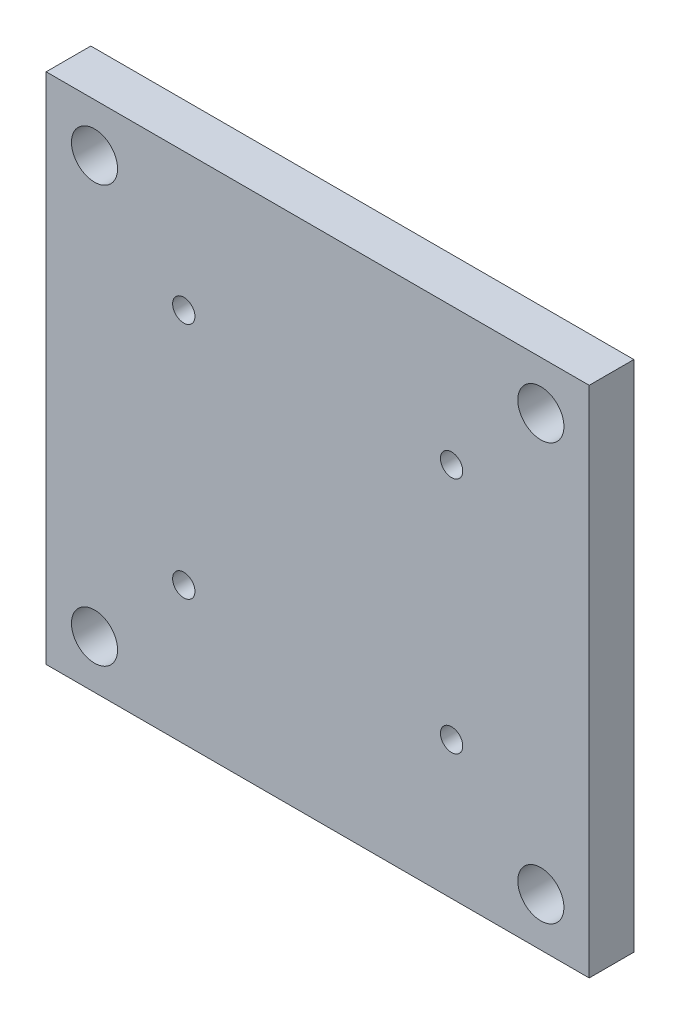
ISO-10303-21;
HEADER;
FILE_DESCRIPTION(('STEP AP214'),'2;1');
FILE_NAME('part.step','',(''),(''),'','','');
FILE_SCHEMA(('AUTOMOTIVE_DESIGN { 1 0 10303 214 1 1 1 1 }'));
ENDSEC;
DATA;
#1=APPLICATION_CONTEXT('core data for automotive mechanical design processes');
#2=APPLICATION_PROTOCOL_DEFINITION('international standard','automotive_design',2000,#1);
#3=PRODUCT_CONTEXT('',#1,'mechanical');
#4=PRODUCT('Part','Part','',(#3));
#5=PRODUCT_RELATED_PRODUCT_CATEGORY('part','',(#4));
#6=PRODUCT_DEFINITION_FORMATION('','',#4);
#7=PRODUCT_DEFINITION_CONTEXT('part definition',#1,'design');
#8=PRODUCT_DEFINITION('design','',#6,#7);
#9=PRODUCT_DEFINITION_SHAPE('','',#8);
#10=(LENGTH_UNIT() NAMED_UNIT(*) SI_UNIT(.MILLI.,.METRE.));
#11=(NAMED_UNIT(*) PLANE_ANGLE_UNIT() SI_UNIT($,.RADIAN.));
#12=(NAMED_UNIT(*) SI_UNIT($,.STERADIAN.) SOLID_ANGLE_UNIT());
#13=UNCERTAINTY_MEASURE_WITH_UNIT(LENGTH_MEASURE(1.E-05),#10,'distance_accuracy_value','');
#14=(GEOMETRIC_REPRESENTATION_CONTEXT(3) GLOBAL_UNCERTAINTY_ASSIGNED_CONTEXT((#13)) GLOBAL_UNIT_ASSIGNED_CONTEXT((#10,
#11,#12)) REPRESENTATION_CONTEXT('',''));
#15=CARTESIAN_POINT('',(0.,0.,0.));
#16=DIRECTION('',(0.,0.,1.));
#17=DIRECTION('',(1.,0.,0.));
#18=AXIS2_PLACEMENT_3D('',#15,#16,#17);
#19=CARTESIAN_POINT('',(18.5,50.5,6.));
#20=DIRECTION('',(0.,0.,-1.));
#21=DIRECTION('',(-1.,0.,0.));
#22=AXIS2_PLACEMENT_3D('',#19,#20,#21);
#23=CYLINDRICAL_SURFACE('',#22,1.5);
#24=CARTESIAN_POINT('',(18.5,50.5,6.));
#25=DIRECTION('',(0.,0.,1.));
#26=DIRECTION('',(1.,0.,0.));
#27=AXIS2_PLACEMENT_3D('',#24,#25,#26);
#28=CIRCLE('',#27,1.5);
#29=CARTESIAN_POINT('',(20.,50.5,6.));
#30=VERTEX_POINT('',#29);
#31=EDGE_CURVE('E164',#30,#30,#28,.T.);
#32=ORIENTED_EDGE('',*,*,#31,.T.);
#33=EDGE_LOOP('',(#32));
#34=FACE_BOUND('',#33,.T.);
#35=CARTESIAN_POINT('',(18.5,50.5,3.));
#36=DIRECTION('',(0.,0.,-1.));
#37=DIRECTION('',(-1.,0.,0.));
#38=AXIS2_PLACEMENT_3D('',#35,#36,#37);
#39=CIRCLE('',#38,1.5);
#40=CARTESIAN_POINT('',(17.,50.5,3.));
#41=VERTEX_POINT('',#40);
#42=EDGE_CURVE('E41',#41,#41,#39,.T.);
#43=ORIENTED_EDGE('',*,*,#42,.T.);
#44=EDGE_LOOP('',(#43));
#45=FACE_BOUND('',#44,.T.);
#46=ADVANCED_FACE('F37',(#34,#45),#23,.F.);
#47=CARTESIAN_POINT('',(54.5,50.5,6.));
#48=DIRECTION('',(0.,0.,-1.));
#49=DIRECTION('',(-1.,0.,0.));
#50=AXIS2_PLACEMENT_3D('',#47,#48,#49);
#51=CYLINDRICAL_SURFACE('',#50,1.5);
#52=CARTESIAN_POINT('',(54.5,50.5,6.));
#53=DIRECTION('',(0.,0.,1.));
#54=DIRECTION('',(1.,0.,0.));
#55=AXIS2_PLACEMENT_3D('',#52,#53,#54);
#56=CIRCLE('',#55,1.5);
#57=CARTESIAN_POINT('',(56.,50.5,6.));
#58=VERTEX_POINT('',#57);
#59=EDGE_CURVE('E155',#58,#58,#56,.T.);
#60=ORIENTED_EDGE('',*,*,#59,.T.);
#61=EDGE_LOOP('',(#60));
#62=FACE_BOUND('',#61,.T.);
#63=CARTESIAN_POINT('',(54.5,50.5,3.));
#64=DIRECTION('',(0.,0.,-1.));
#65=DIRECTION('',(-1.,0.,0.));
#66=AXIS2_PLACEMENT_3D('',#63,#64,#65);
#67=CIRCLE('',#66,1.5);
#68=CARTESIAN_POINT('',(53.,50.5,3.));
#69=VERTEX_POINT('',#68);
#70=EDGE_CURVE('E134',#69,#69,#67,.T.);
#71=ORIENTED_EDGE('',*,*,#70,.T.);
#72=EDGE_LOOP('',(#71));
#73=FACE_BOUND('',#72,.T.);
#74=ADVANCED_FACE('F237',(#62,#73),#51,.F.);
#75=CARTESIAN_POINT('',(54.5,18.5,6.));
#76=DIRECTION('',(0.,0.,-1.));
#77=DIRECTION('',(-1.,0.,0.));
#78=AXIS2_PLACEMENT_3D('',#75,#76,#77);
#79=CYLINDRICAL_SURFACE('',#78,1.5);
#80=CARTESIAN_POINT('',(54.5,18.5,6.));
#81=DIRECTION('',(0.,0.,1.));
#82=DIRECTION('',(1.,0.,0.));
#83=AXIS2_PLACEMENT_3D('',#80,#81,#82);
#84=CIRCLE('',#83,1.5);
#85=CARTESIAN_POINT('',(56.,18.5,6.));
#86=VERTEX_POINT('',#85);
#87=EDGE_CURVE('E148',#86,#86,#84,.T.);
#88=ORIENTED_EDGE('',*,*,#87,.T.);
#89=EDGE_LOOP('',(#88));
#90=FACE_BOUND('',#89,.T.);
#91=CARTESIAN_POINT('',(54.5,18.5,3.));
#92=DIRECTION('',(0.,0.,-1.));
#93=DIRECTION('',(-1.,0.,0.));
#94=AXIS2_PLACEMENT_3D('',#91,#92,#93);
#95=CIRCLE('',#94,1.5);
#96=CARTESIAN_POINT('',(53.,18.5,3.));
#97=VERTEX_POINT('',#96);
#98=EDGE_CURVE('E130',#97,#97,#95,.T.);
#99=ORIENTED_EDGE('',*,*,#98,.T.);
#100=EDGE_LOOP('',(#99));
#101=FACE_BOUND('',#100,.T.);
#102=ADVANCED_FACE('F243',(#90,#101),#79,.F.);
#103=CARTESIAN_POINT('',(18.5,18.5,6.));
#104=DIRECTION('',(0.,0.,-1.));
#105=DIRECTION('',(-1.,0.,0.));
#106=AXIS2_PLACEMENT_3D('',#103,#104,#105);
#107=CYLINDRICAL_SURFACE('',#106,1.5);
#108=CARTESIAN_POINT('',(18.5,18.5,6.));
#109=DIRECTION('',(0.,0.,1.));
#110=DIRECTION('',(1.,0.,0.));
#111=AXIS2_PLACEMENT_3D('',#108,#109,#110);
#112=CIRCLE('',#111,1.5);
#113=CARTESIAN_POINT('',(20.,18.5,6.));
#114=VERTEX_POINT('',#113);
#115=EDGE_CURVE('E142',#114,#114,#112,.T.);
#116=ORIENTED_EDGE('',*,*,#115,.T.);
#117=EDGE_LOOP('',(#116));
#118=FACE_BOUND('',#117,.T.);
#119=CARTESIAN_POINT('',(18.5,18.5,3.));
#120=DIRECTION('',(0.,0.,-1.));
#121=DIRECTION('',(-1.,0.,0.));
#122=AXIS2_PLACEMENT_3D('',#119,#120,#121);
#123=CIRCLE('',#122,1.5);
#124=CARTESIAN_POINT('',(17.,18.5,3.));
#125=VERTEX_POINT('',#124);
#126=EDGE_CURVE('E126',#125,#125,#123,.T.);
#127=ORIENTED_EDGE('',*,*,#126,.T.);
#128=EDGE_LOOP('',(#127));
#129=FACE_BOUND('',#128,.T.);
#130=ADVANCED_FACE('F269',(#118,#129),#107,.F.);
#131=CARTESIAN_POINT('',(0.,0.,6.));
#132=DIRECTION('',(0.,0.,-1.));
#133=DIRECTION('',(-1.,0.,0.));
#134=AXIS2_PLACEMENT_3D('',#131,#132,#133);
#135=PLANE('',#134);
#136=DIRECTION('',(0.,-1.,0.));
#137=VECTOR('',#136,1.);
#138=CARTESIAN_POINT('',(0.,0.,6.));
#139=LINE('',#138,#137);
#140=CARTESIAN_POINT('',(0.,69.,6.));
#141=VERTEX_POINT('',#140);
#142=CARTESIAN_POINT('',(0.,0.,6.));
#143=VERTEX_POINT('',#142);
#144=EDGE_CURVE('E93',#141,#143,#139,.T.);
#145=ORIENTED_EDGE('',*,*,#144,.T.);
#146=DIRECTION('',(1.,0.,0.));
#147=VECTOR('',#146,1.);
#148=CARTESIAN_POINT('',(0.,0.,6.));
#149=LINE('',#148,#147);
#150=CARTESIAN_POINT('',(73.,0.,6.));
#151=VERTEX_POINT('',#150);
#152=EDGE_CURVE('E87',#143,#151,#149,.T.);
#153=ORIENTED_EDGE('',*,*,#152,.T.);
#154=DIRECTION('',(0.,1.,0.));
#155=VECTOR('',#154,1.);
#156=CARTESIAN_POINT('',(73.,0.,6.));
#157=LINE('',#156,#155);
#158=CARTESIAN_POINT('',(73.,69.,6.));
#159=VERTEX_POINT('',#158);
#160=EDGE_CURVE('E91',#151,#159,#157,.T.);
#161=ORIENTED_EDGE('',*,*,#160,.T.);
#162=DIRECTION('',(-1.,0.,0.));
#163=VECTOR('',#162,1.);
#164=CARTESIAN_POINT('',(0.,69.,6.));
#165=LINE('',#164,#163);
#166=EDGE_CURVE('E57',#159,#141,#165,.T.);
#167=ORIENTED_EDGE('',*,*,#166,.T.);
#168=EDGE_LOOP('',(#145,#153,#161,#167));
#169=FACE_BOUND('',#168,.T.);
#170=CARTESIAN_POINT('',(6.5,6.5,6.));
#171=DIRECTION('',(0.,0.,1.));
#172=DIRECTION('',(1.,0.,0.));
#173=AXIS2_PLACEMENT_3D('',#170,#171,#172);
#174=CIRCLE('',#173,3.1);
#175=CARTESIAN_POINT('',(9.6,6.5,6.));
#176=VERTEX_POINT('',#175);
#177=EDGE_CURVE('E115',#176,#176,#174,.T.);
#178=ORIENTED_EDGE('',*,*,#177,.F.);
#179=EDGE_LOOP('',(#178));
#180=FACE_BOUND('',#179,.T.);
#181=CARTESIAN_POINT('',(66.5,6.5,6.));
#182=DIRECTION('',(0.,0.,1.));
#183=DIRECTION('',(-1.,0.,0.));
#184=AXIS2_PLACEMENT_3D('',#181,#182,#183);
#185=CIRCLE('',#184,3.1);
#186=CARTESIAN_POINT('',(63.4,6.5,6.));
#187=VERTEX_POINT('',#186);
#188=EDGE_CURVE('E185',#187,#187,#185,.T.);
#189=ORIENTED_EDGE('',*,*,#188,.F.);
#190=EDGE_LOOP('',(#189));
#191=FACE_BOUND('',#190,.T.);
#192=CARTESIAN_POINT('',(66.5,62.5,6.));
#193=DIRECTION('',(0.,0.,1.));
#194=DIRECTION('',(1.,0.,0.));
#195=AXIS2_PLACEMENT_3D('',#192,#193,#194);
#196=CIRCLE('',#195,3.1);
#197=CARTESIAN_POINT('',(69.6,62.5,6.));
#198=VERTEX_POINT('',#197);
#199=EDGE_CURVE('E177',#198,#198,#196,.T.);
#200=ORIENTED_EDGE('',*,*,#199,.F.);
#201=EDGE_LOOP('',(#200));
#202=FACE_BOUND('',#201,.T.);
#203=CARTESIAN_POINT('',(6.5,62.5,6.));
#204=DIRECTION('',(0.,0.,1.));
#205=DIRECTION('',(-1.,0.,0.));
#206=AXIS2_PLACEMENT_3D('',#203,#204,#205);
#207=CIRCLE('',#206,3.1);
#208=CARTESIAN_POINT('',(3.4,62.5,6.));
#209=VERTEX_POINT('',#208);
#210=EDGE_CURVE('E169',#209,#209,#207,.T.);
#211=ORIENTED_EDGE('',*,*,#210,.F.);
#212=EDGE_LOOP('',(#211));
#213=FACE_BOUND('',#212,.T.);
#214=ORIENTED_EDGE('',*,*,#31,.F.);
#215=EDGE_LOOP('',(#214));
#216=FACE_BOUND('',#215,.T.);
#217=ORIENTED_EDGE('',*,*,#59,.F.);
#218=EDGE_LOOP('',(#217));
#219=FACE_BOUND('',#218,.T.);
#220=ORIENTED_EDGE('',*,*,#87,.F.);
#221=EDGE_LOOP('',(#220));
#222=FACE_BOUND('',#221,.T.);
#223=ORIENTED_EDGE('',*,*,#115,.F.);
#224=EDGE_LOOP('',(#223));
#225=FACE_BOUND('',#224,.T.);
#226=ADVANCED_FACE('F88',(#169,#180,#191,#202,#213,#216,#219,#222,#225),#135,.F.);
#227=CARTESIAN_POINT('',(0.,0.,0.));
#228=DIRECTION('',(0.,0.,-1.));
#229=DIRECTION('',(-1.,0.,0.));
#230=AXIS2_PLACEMENT_3D('',#227,#228,#229);
#231=PLANE('',#230);
#232=CARTESIAN_POINT('',(54.5,18.5,0.));
#233=DIRECTION('',(0.,0.,-1.));
#234=DIRECTION('',(-1.,0.,0.));
#235=AXIS2_PLACEMENT_3D('',#232,#233,#234);
#236=CIRCLE('',#235,2.74999999999999);
#237=CARTESIAN_POINT('',(51.75,18.5,0.));
#238=VERTEX_POINT('',#237);
#239=EDGE_CURVE('E502',#238,#238,#236,.T.);
#240=ORIENTED_EDGE('',*,*,#239,.F.);
#241=EDGE_LOOP('',(#240));
#242=FACE_BOUND('',#241,.T.);
#243=CARTESIAN_POINT('',(18.5,18.5,0.));
#244=DIRECTION('',(0.,0.,-1.));
#245=DIRECTION('',(-1.,0.,0.));
#246=AXIS2_PLACEMENT_3D('',#243,#244,#245);
#247=CIRCLE('',#246,2.75);
#248=CARTESIAN_POINT('',(15.75,18.5,0.));
#249=VERTEX_POINT('',#248);
#250=EDGE_CURVE('E486',#249,#249,#247,.T.);
#251=ORIENTED_EDGE('',*,*,#250,.F.);
#252=EDGE_LOOP('',(#251));
#253=FACE_BOUND('',#252,.T.);
#254=CARTESIAN_POINT('',(18.5,50.5,0.));
#255=DIRECTION('',(0.,0.,-1.));
#256=DIRECTION('',(-1.,0.,0.));
#257=AXIS2_PLACEMENT_3D('',#254,#255,#256);
#258=CIRCLE('',#257,2.75);
#259=CARTESIAN_POINT('',(15.75,50.5,0.));
#260=VERTEX_POINT('',#259);
#261=EDGE_CURVE('E485',#260,#260,#258,.T.);
#262=ORIENTED_EDGE('',*,*,#261,.F.);
#263=EDGE_LOOP('',(#262));
#264=FACE_BOUND('',#263,.T.);
#265=CARTESIAN_POINT('',(54.5,50.5,0.));
#266=DIRECTION('',(0.,0.,-1.));
#267=DIRECTION('',(-1.,0.,0.));
#268=AXIS2_PLACEMENT_3D('',#265,#266,#267);
#269=CIRCLE('',#268,2.75);
#270=CARTESIAN_POINT('',(51.75,50.5,0.));
#271=VERTEX_POINT('',#270);
#272=EDGE_CURVE('E158',#271,#271,#269,.T.);
#273=ORIENTED_EDGE('',*,*,#272,.F.);
#274=EDGE_LOOP('',(#273));
#275=FACE_BOUND('',#274,.T.);
#276=CARTESIAN_POINT('',(66.5,62.5,0.));
#277=DIRECTION('',(0.,0.,1.));
#278=DIRECTION('',(1.,0.,0.));
#279=AXIS2_PLACEMENT_3D('',#276,#277,#278);
#280=CIRCLE('',#279,3.1);
#281=CARTESIAN_POINT('',(69.6,62.5,0.));
#282=VERTEX_POINT('',#281);
#283=EDGE_CURVE('E173',#282,#282,#280,.T.);
#284=ORIENTED_EDGE('',*,*,#283,.T.);
#285=EDGE_LOOP('',(#284));
#286=FACE_BOUND('',#285,.T.);
#287=CARTESIAN_POINT('',(6.5,6.5,0.));
#288=DIRECTION('',(0.,0.,1.));
#289=DIRECTION('',(1.,0.,0.));
#290=AXIS2_PLACEMENT_3D('',#287,#288,#289);
#291=CIRCLE('',#290,3.1);
#292=CARTESIAN_POINT('',(9.6,6.5,0.));
#293=VERTEX_POINT('',#292);
#294=EDGE_CURVE('E189',#293,#293,#291,.T.);
#295=ORIENTED_EDGE('',*,*,#294,.T.);
#296=EDGE_LOOP('',(#295));
#297=FACE_BOUND('',#296,.T.);
#298=DIRECTION('',(0.,-1.,0.));
#299=VECTOR('',#298,1.);
#300=CARTESIAN_POINT('',(0.,0.,0.));
#301=LINE('',#300,#299);
#302=CARTESIAN_POINT('',(0.,69.,0.));
#303=VERTEX_POINT('',#302);
#304=CARTESIAN_POINT('',(0.,0.,0.));
#305=VERTEX_POINT('',#304);
#306=EDGE_CURVE('E111',#303,#305,#301,.T.);
#307=ORIENTED_EDGE('',*,*,#306,.F.);
#308=DIRECTION('',(-1.,0.,0.));
#309=VECTOR('',#308,1.);
#310=CARTESIAN_POINT('',(0.,69.,0.));
#311=LINE('',#310,#309);
#312=CARTESIAN_POINT('',(73.,69.,0.));
#313=VERTEX_POINT('',#312);
#314=EDGE_CURVE('E80',#313,#303,#311,.T.);
#315=ORIENTED_EDGE('',*,*,#314,.F.);
#316=DIRECTION('',(0.,1.,0.));
#317=VECTOR('',#316,1.);
#318=CARTESIAN_POINT('',(73.,0.,0.));
#319=LINE('',#318,#317);
#320=CARTESIAN_POINT('',(73.,0.,0.));
#321=VERTEX_POINT('',#320);
#322=EDGE_CURVE('E74',#321,#313,#319,.T.);
#323=ORIENTED_EDGE('',*,*,#322,.F.);
#324=DIRECTION('',(1.,0.,0.));
#325=VECTOR('',#324,1.);
#326=CARTESIAN_POINT('',(0.,0.,0.));
#327=LINE('',#326,#325);
#328=EDGE_CURVE('E98',#305,#321,#327,.T.);
#329=ORIENTED_EDGE('',*,*,#328,.F.);
#330=EDGE_LOOP('',(#307,#315,#323,#329));
#331=FACE_BOUND('',#330,.T.);
#332=CARTESIAN_POINT('',(66.5,6.5,0.));
#333=DIRECTION('',(0.,0.,1.));
#334=DIRECTION('',(-1.,0.,0.));
#335=AXIS2_PLACEMENT_3D('',#332,#333,#334);
#336=CIRCLE('',#335,3.1);
#337=CARTESIAN_POINT('',(63.4,6.5,0.));
#338=VERTEX_POINT('',#337);
#339=EDGE_CURVE('E181',#338,#338,#336,.T.);
#340=ORIENTED_EDGE('',*,*,#339,.T.);
#341=EDGE_LOOP('',(#340));
#342=FACE_BOUND('',#341,.T.);
#343=CARTESIAN_POINT('',(6.5,62.5,0.));
#344=DIRECTION('',(0.,0.,1.));
#345=DIRECTION('',(-1.,0.,0.));
#346=AXIS2_PLACEMENT_3D('',#343,#344,#345);
#347=CIRCLE('',#346,3.1);
#348=CARTESIAN_POINT('',(3.4,62.5,0.));
#349=VERTEX_POINT('',#348);
#350=EDGE_CURVE('E168',#349,#349,#347,.T.);
#351=ORIENTED_EDGE('',*,*,#350,.T.);
#352=EDGE_LOOP('',(#351));
#353=FACE_BOUND('',#352,.T.);
#354=ADVANCED_FACE('F218',(#242,#253,#264,#275,#286,#297,#331,#342,#353),#231,.T.);
#355=CARTESIAN_POINT('',(0.,0.,6.));
#356=DIRECTION('',(1.,0.,0.));
#357=DIRECTION('',(0.,0.,-1.));
#358=AXIS2_PLACEMENT_3D('',#355,#356,#357);
#359=PLANE('',#358);
#360=ORIENTED_EDGE('',*,*,#306,.T.);
#361=DIRECTION('',(0.,0.,-1.));
#362=VECTOR('',#361,1.);
#363=CARTESIAN_POINT('',(0.,0.,6.));
#364=LINE('',#363,#362);
#365=EDGE_CURVE('E11',#143,#305,#364,.T.);
#366=ORIENTED_EDGE('',*,*,#365,.F.);
#367=ORIENTED_EDGE('',*,*,#144,.F.);
#368=DIRECTION('',(0.,0.,-1.));
#369=VECTOR('',#368,1.);
#370=CARTESIAN_POINT('',(0.,69.,6.));
#371=LINE('',#370,#369);
#372=EDGE_CURVE('E107',#141,#303,#371,.T.);
#373=ORIENTED_EDGE('',*,*,#372,.T.);
#374=EDGE_LOOP('',(#360,#366,#367,#373));
#375=FACE_BOUND('',#374,.T.);
#376=ADVANCED_FACE('F39',(#375),#359,.F.);
#377=CARTESIAN_POINT('',(0.,0.,6.));
#378=DIRECTION('',(0.,1.,0.));
#379=DIRECTION('',(0.,0.,1.));
#380=AXIS2_PLACEMENT_3D('',#377,#378,#379);
#381=PLANE('',#380);
#382=ORIENTED_EDGE('',*,*,#328,.T.);
#383=DIRECTION('',(0.,0.,-1.));
#384=VECTOR('',#383,1.);
#385=CARTESIAN_POINT('',(73.,0.,6.));
#386=LINE('',#385,#384);
#387=EDGE_CURVE('E48',#151,#321,#386,.T.);
#388=ORIENTED_EDGE('',*,*,#387,.F.);
#389=ORIENTED_EDGE('',*,*,#152,.F.);
#390=ORIENTED_EDGE('',*,*,#365,.T.);
#391=EDGE_LOOP('',(#382,#388,#389,#390));
#392=FACE_BOUND('',#391,.T.);
#393=ADVANCED_FACE('F97',(#392),#381,.F.);
#394=CARTESIAN_POINT('',(73.,0.,6.));
#395=DIRECTION('',(-1.,0.,0.));
#396=DIRECTION('',(0.,0.,1.));
#397=AXIS2_PLACEMENT_3D('',#394,#395,#396);
#398=PLANE('',#397);
#399=ORIENTED_EDGE('',*,*,#322,.T.);
#400=DIRECTION('',(0.,0.,-1.));
#401=VECTOR('',#400,1.);
#402=CARTESIAN_POINT('',(73.,69.,6.));
#403=LINE('',#402,#401);
#404=EDGE_CURVE('E100',#159,#313,#403,.T.);
#405=ORIENTED_EDGE('',*,*,#404,.F.);
#406=ORIENTED_EDGE('',*,*,#160,.F.);
#407=ORIENTED_EDGE('',*,*,#387,.T.);
#408=EDGE_LOOP('',(#399,#405,#406,#407));
#409=FACE_BOUND('',#408,.T.);
#410=ADVANCED_FACE('F102',(#409),#398,.F.);
#411=CARTESIAN_POINT('',(0.,69.,6.));
#412=DIRECTION('',(0.,-1.,0.));
#413=DIRECTION('',(0.,0.,-1.));
#414=AXIS2_PLACEMENT_3D('',#411,#412,#413);
#415=PLANE('',#414);
#416=ORIENTED_EDGE('',*,*,#314,.T.);
#417=ORIENTED_EDGE('',*,*,#372,.F.);
#418=ORIENTED_EDGE('',*,*,#166,.F.);
#419=ORIENTED_EDGE('',*,*,#404,.T.);
#420=EDGE_LOOP('',(#416,#417,#418,#419));
#421=FACE_BOUND('',#420,.T.);
#422=ADVANCED_FACE('F224',(#421),#415,.F.);
#423=CARTESIAN_POINT('',(6.5,6.5,6.));
#424=DIRECTION('',(0.,0.,-1.));
#425=DIRECTION('',(-1.,0.,0.));
#426=AXIS2_PLACEMENT_3D('',#423,#424,#425);
#427=CYLINDRICAL_SURFACE('',#426,3.1);
#428=ORIENTED_EDGE('',*,*,#177,.T.);
#429=EDGE_LOOP('',(#428));
#430=FACE_BOUND('',#429,.T.);
#431=ORIENTED_EDGE('',*,*,#294,.F.);
#432=EDGE_LOOP('',(#431));
#433=FACE_BOUND('',#432,.T.);
#434=ADVANCED_FACE('F221',(#430,#433),#427,.F.);
#435=CARTESIAN_POINT('',(66.5,6.5,6.));
#436=DIRECTION('',(0.,0.,-1.));
#437=DIRECTION('',(-1.,0.,0.));
#438=AXIS2_PLACEMENT_3D('',#435,#436,#437);
#439=CYLINDRICAL_SURFACE('',#438,3.1);
#440=ORIENTED_EDGE('',*,*,#188,.T.);
#441=EDGE_LOOP('',(#440));
#442=FACE_BOUND('',#441,.T.);
#443=ORIENTED_EDGE('',*,*,#339,.F.);
#444=EDGE_LOOP('',(#443));
#445=FACE_BOUND('',#444,.T.);
#446=ADVANCED_FACE('F223',(#442,#445),#439,.F.);
#447=CARTESIAN_POINT('',(66.5,62.5,6.));
#448=DIRECTION('',(0.,0.,-1.));
#449=DIRECTION('',(-1.,0.,0.));
#450=AXIS2_PLACEMENT_3D('',#447,#448,#449);
#451=CYLINDRICAL_SURFACE('',#450,3.1);
#452=ORIENTED_EDGE('',*,*,#199,.T.);
#453=EDGE_LOOP('',(#452));
#454=FACE_BOUND('',#453,.T.);
#455=ORIENTED_EDGE('',*,*,#283,.F.);
#456=EDGE_LOOP('',(#455));
#457=FACE_BOUND('',#456,.T.);
#458=ADVANCED_FACE('F231',(#454,#457),#451,.F.);
#459=CARTESIAN_POINT('',(6.5,62.5,6.));
#460=DIRECTION('',(0.,0.,-1.));
#461=DIRECTION('',(-1.,0.,0.));
#462=AXIS2_PLACEMENT_3D('',#459,#460,#461);
#463=CYLINDRICAL_SURFACE('',#462,3.1);
#464=ORIENTED_EDGE('',*,*,#210,.T.);
#465=EDGE_LOOP('',(#464));
#466=FACE_BOUND('',#465,.T.);
#467=ORIENTED_EDGE('',*,*,#350,.F.);
#468=EDGE_LOOP('',(#467));
#469=FACE_BOUND('',#468,.T.);
#470=ADVANCED_FACE('F248',(#466,#469),#463,.F.);
#471=CARTESIAN_POINT('',(18.5,18.5,3.));
#472=DIRECTION('',(0.,0.,-1.));
#473=DIRECTION('',(-1.,0.,0.));
#474=AXIS2_PLACEMENT_3D('',#471,#472,#473);
#475=CYLINDRICAL_SURFACE('',#474,2.75);
#476=CARTESIAN_POINT('',(18.5,18.5,3.));
#477=DIRECTION('',(0.,0.,-1.));
#478=DIRECTION('',(-1.,0.,0.));
#479=AXIS2_PLACEMENT_3D('',#476,#477,#478);
#480=CIRCLE('',#479,2.75);
#481=CARTESIAN_POINT('',(15.75,18.5,3.));
#482=VERTEX_POINT('',#481);
#483=EDGE_CURVE('E483',#482,#482,#480,.T.);
#484=ORIENTED_EDGE('',*,*,#483,.F.);
#485=EDGE_LOOP('',(#484));
#486=FACE_BOUND('',#485,.T.);
#487=ORIENTED_EDGE('',*,*,#250,.T.);
#488=EDGE_LOOP('',(#487));
#489=FACE_BOUND('',#488,.T.);
#490=ADVANCED_FACE('F251',(#486,#489),#475,.F.);
#491=CARTESIAN_POINT('',(18.5,18.5,3.));
#492=DIRECTION('',(0.,0.,-1.));
#493=DIRECTION('',(-1.,0.,0.));
#494=AXIS2_PLACEMENT_3D('',#491,#492,#493);
#495=PLANE('',#494);
#496=ORIENTED_EDGE('',*,*,#126,.F.);
#497=EDGE_LOOP('',(#496));
#498=FACE_BOUND('',#497,.T.);
#499=ORIENTED_EDGE('',*,*,#483,.T.);
#500=EDGE_LOOP('',(#499));
#501=FACE_BOUND('',#500,.T.);
#502=ADVANCED_FACE('F317',(#498,#501),#495,.T.);
#503=CARTESIAN_POINT('',(54.5,18.5,3.));
#504=DIRECTION('',(0.,0.,-1.));
#505=DIRECTION('',(-1.,0.,0.));
#506=AXIS2_PLACEMENT_3D('',#503,#504,#505);
#507=CYLINDRICAL_SURFACE('',#506,2.74999999999999);
#508=CARTESIAN_POINT('',(54.5,18.5,3.));
#509=DIRECTION('',(0.,0.,-1.));
#510=DIRECTION('',(-1.,0.,0.));
#511=AXIS2_PLACEMENT_3D('',#508,#509,#510);
#512=CIRCLE('',#511,2.74999999999999);
#513=CARTESIAN_POINT('',(51.75,18.5,3.));
#514=VERTEX_POINT('',#513);
#515=EDGE_CURVE('E495',#514,#514,#512,.T.);
#516=ORIENTED_EDGE('',*,*,#515,.F.);
#517=EDGE_LOOP('',(#516));
#518=FACE_BOUND('',#517,.T.);
#519=ORIENTED_EDGE('',*,*,#239,.T.);
#520=EDGE_LOOP('',(#519));
#521=FACE_BOUND('',#520,.T.);
#522=ADVANCED_FACE('F328',(#518,#521),#507,.F.);
#523=CARTESIAN_POINT('',(54.5,18.5,3.));
#524=DIRECTION('',(0.,0.,-1.));
#525=DIRECTION('',(-1.,0.,0.));
#526=AXIS2_PLACEMENT_3D('',#523,#524,#525);
#527=PLANE('',#526);
#528=ORIENTED_EDGE('',*,*,#98,.F.);
#529=EDGE_LOOP('',(#528));
#530=FACE_BOUND('',#529,.T.);
#531=ORIENTED_EDGE('',*,*,#515,.T.);
#532=EDGE_LOOP('',(#531));
#533=FACE_BOUND('',#532,.T.);
#534=ADVANCED_FACE('F338',(#530,#533),#527,.T.);
#535=CARTESIAN_POINT('',(54.5,50.5,3.));
#536=DIRECTION('',(0.,0.,-1.));
#537=DIRECTION('',(-1.,0.,0.));
#538=AXIS2_PLACEMENT_3D('',#535,#536,#537);
#539=CYLINDRICAL_SURFACE('',#538,2.75);
#540=CARTESIAN_POINT('',(54.5,50.5,3.));
#541=DIRECTION('',(0.,0.,-1.));
#542=DIRECTION('',(-1.,0.,0.));
#543=AXIS2_PLACEMENT_3D('',#540,#541,#542);
#544=CIRCLE('',#543,2.75);
#545=CARTESIAN_POINT('',(51.75,50.5,3.));
#546=VERTEX_POINT('',#545);
#547=EDGE_CURVE('E131',#546,#546,#544,.T.);
#548=ORIENTED_EDGE('',*,*,#547,.F.);
#549=EDGE_LOOP('',(#548));
#550=FACE_BOUND('',#549,.T.);
#551=ORIENTED_EDGE('',*,*,#272,.T.);
#552=EDGE_LOOP('',(#551));
#553=FACE_BOUND('',#552,.T.);
#554=ADVANCED_FACE('F348',(#550,#553),#539,.F.);
#555=CARTESIAN_POINT('',(54.5,50.5,3.));
#556=DIRECTION('',(0.,0.,-1.));
#557=DIRECTION('',(-1.,0.,0.));
#558=AXIS2_PLACEMENT_3D('',#555,#556,#557);
#559=PLANE('',#558);
#560=ORIENTED_EDGE('',*,*,#70,.F.);
#561=EDGE_LOOP('',(#560));
#562=FACE_BOUND('',#561,.T.);
#563=ORIENTED_EDGE('',*,*,#547,.T.);
#564=EDGE_LOOP('',(#563));
#565=FACE_BOUND('',#564,.T.);
#566=ADVANCED_FACE('F358',(#562,#565),#559,.T.);
#567=CARTESIAN_POINT('',(18.5,50.5,3.));
#568=DIRECTION('',(0.,0.,-1.));
#569=DIRECTION('',(-1.,0.,0.));
#570=AXIS2_PLACEMENT_3D('',#567,#568,#569);
#571=CYLINDRICAL_SURFACE('',#570,2.75);
#572=CARTESIAN_POINT('',(18.5,50.5,3.));
#573=DIRECTION('',(0.,0.,-1.));
#574=DIRECTION('',(-1.,0.,0.));
#575=AXIS2_PLACEMENT_3D('',#572,#573,#574);
#576=CIRCLE('',#575,2.75);
#577=CARTESIAN_POINT('',(15.75,50.5,3.));
#578=VERTEX_POINT('',#577);
#579=EDGE_CURVE('E492',#578,#578,#576,.T.);
#580=ORIENTED_EDGE('',*,*,#579,.F.);
#581=EDGE_LOOP('',(#580));
#582=FACE_BOUND('',#581,.T.);
#583=ORIENTED_EDGE('',*,*,#261,.T.);
#584=EDGE_LOOP('',(#583));
#585=FACE_BOUND('',#584,.T.);
#586=ADVANCED_FACE('F368',(#582,#585),#571,.F.);
#587=CARTESIAN_POINT('',(18.5,50.5,3.));
#588=DIRECTION('',(0.,0.,-1.));
#589=DIRECTION('',(-1.,0.,0.));
#590=AXIS2_PLACEMENT_3D('',#587,#588,#589);
#591=PLANE('',#590);
#592=ORIENTED_EDGE('',*,*,#42,.F.);
#593=EDGE_LOOP('',(#592));
#594=FACE_BOUND('',#593,.T.);
#595=ORIENTED_EDGE('',*,*,#579,.T.);
#596=EDGE_LOOP('',(#595));
#597=FACE_BOUND('',#596,.T.);
#598=ADVANCED_FACE('F378',(#594,#597),#591,.T.);
#599=CLOSED_SHELL('',(#46,#74,#102,#130,#226,#354,#376,#393,#410,#422,#434,#446,#458,#470,#490,
#502,#522,#534,#554,#566,#586,#598));
#600=MANIFOLD_SOLID_BREP('B2',#599);
#601=ADVANCED_BREP_SHAPE_REPRESENTATION('',(#18,#600),#14);
#602=SHAPE_DEFINITION_REPRESENTATION(#9,#601);
ENDSEC;
END-ISO-10303-21;
